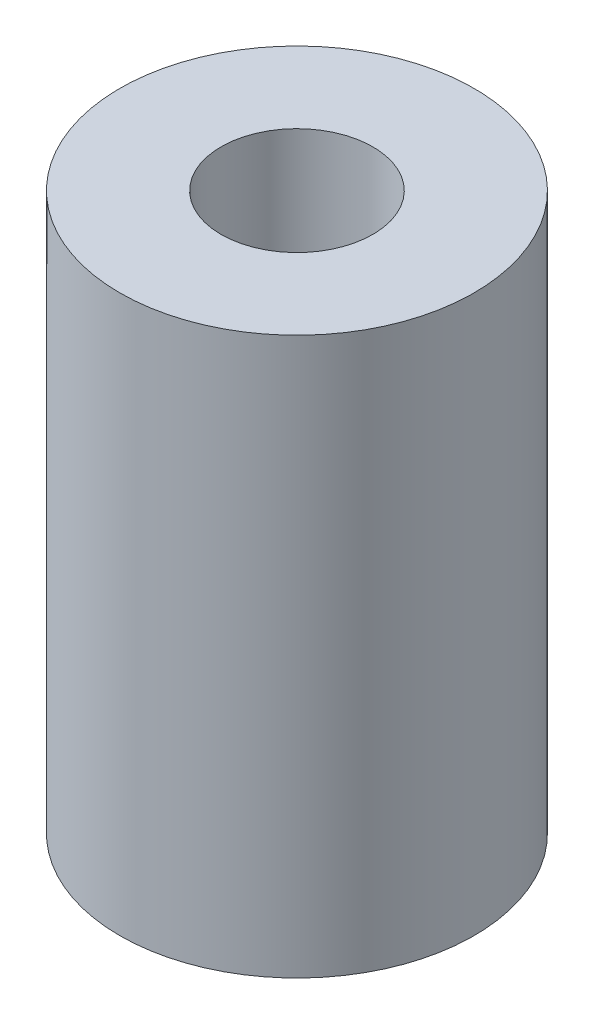
ISO-10303-21;
HEADER;
FILE_DESCRIPTION(('STEP AP214'),'2;1');
FILE_NAME('part.step','',(''),(''),'','','');
FILE_SCHEMA(('AUTOMOTIVE_DESIGN { 1 0 10303 214 1 1 1 1 }'));
ENDSEC;
DATA;
#1=APPLICATION_CONTEXT('core data for automotive mechanical design processes');
#2=APPLICATION_PROTOCOL_DEFINITION('international standard','automotive_design',2000,#1);
#3=PRODUCT_CONTEXT('',#1,'mechanical');
#4=PRODUCT('Part','Part','',(#3));
#5=PRODUCT_RELATED_PRODUCT_CATEGORY('part','',(#4));
#6=PRODUCT_DEFINITION_FORMATION('','',#4);
#7=PRODUCT_DEFINITION_CONTEXT('part definition',#1,'design');
#8=PRODUCT_DEFINITION('design','',#6,#7);
#9=PRODUCT_DEFINITION_SHAPE('','',#8);
#10=(LENGTH_UNIT() NAMED_UNIT(*) SI_UNIT(.MILLI.,.METRE.));
#11=(NAMED_UNIT(*) PLANE_ANGLE_UNIT() SI_UNIT($,.RADIAN.));
#12=(NAMED_UNIT(*) SI_UNIT($,.STERADIAN.) SOLID_ANGLE_UNIT());
#13=UNCERTAINTY_MEASURE_WITH_UNIT(LENGTH_MEASURE(1.E-05),#10,'distance_accuracy_value','');
#14=(GEOMETRIC_REPRESENTATION_CONTEXT(3) GLOBAL_UNCERTAINTY_ASSIGNED_CONTEXT((#13)) GLOBAL_UNIT_ASSIGNED_CONTEXT((#10,
#11,#12)) REPRESENTATION_CONTEXT('',''));
#15=CARTESIAN_POINT('',(0.,0.,0.));
#16=DIRECTION('',(0.,0.,1.));
#17=DIRECTION('',(1.,0.,0.));
#18=AXIS2_PLACEMENT_3D('',#15,#16,#17);
#19=CARTESIAN_POINT('',(0.,11.,0.));
#20=DIRECTION('',(0.,-1.,0.));
#21=DIRECTION('',(0.,0.,-1.));
#22=AXIS2_PLACEMENT_3D('',#19,#20,#21);
#23=CYLINDRICAL_SURFACE('',#22,7.);
#24=CARTESIAN_POINT('',(0.,11.,0.));
#25=DIRECTION('',(0.,1.,0.));
#26=DIRECTION('',(0.,0.,1.));
#27=AXIS2_PLACEMENT_3D('',#24,#25,#26);
#28=CIRCLE('',#27,7.);
#29=CARTESIAN_POINT('',(0.,11.,7.));
#30=VERTEX_POINT('',#29);
#31=EDGE_CURVE('E10',#30,#30,#28,.T.);
#32=ORIENTED_EDGE('',*,*,#31,.F.);
#33=EDGE_LOOP('',(#32));
#34=FACE_BOUND('',#33,.T.);
#35=CARTESIAN_POINT('',(0.,-11.,0.));
#36=DIRECTION('',(0.,1.,0.));
#37=DIRECTION('',(0.,0.,1.));
#38=AXIS2_PLACEMENT_3D('',#35,#36,#37);
#39=CIRCLE('',#38,7.);
#40=CARTESIAN_POINT('',(0.,-11.,7.));
#41=VERTEX_POINT('',#40);
#42=EDGE_CURVE('E38',#41,#41,#39,.T.);
#43=ORIENTED_EDGE('',*,*,#42,.T.);
#44=EDGE_LOOP('',(#43));
#45=FACE_BOUND('',#44,.T.);
#46=ADVANCED_FACE('F35',(#34,#45),#23,.T.);
#47=CARTESIAN_POINT('',(0.,11.,0.));
#48=DIRECTION('',(0.,1.,0.));
#49=DIRECTION('',(0.,0.,1.));
#50=AXIS2_PLACEMENT_3D('',#47,#48,#49);
#51=PLANE('',#50);
#52=CARTESIAN_POINT('',(0.,11.,0.));
#53=DIRECTION('',(0.,1.,0.));
#54=DIRECTION('',(0.,0.,1.));
#55=AXIS2_PLACEMENT_3D('',#52,#53,#54);
#56=CIRCLE('',#55,3.);
#57=CARTESIAN_POINT('',(0.,11.,3.));
#58=VERTEX_POINT('',#57);
#59=EDGE_CURVE('E45',#58,#58,#56,.T.);
#60=ORIENTED_EDGE('',*,*,#59,.F.);
#61=EDGE_LOOP('',(#60));
#62=FACE_BOUND('',#61,.T.);
#63=ORIENTED_EDGE('',*,*,#31,.T.);
#64=EDGE_LOOP('',(#63));
#65=FACE_BOUND('',#64,.T.);
#66=ADVANCED_FACE('F72',(#62,#65),#51,.T.);
#67=CARTESIAN_POINT('',(0.,-11.,0.));
#68=DIRECTION('',(0.,1.,0.));
#69=DIRECTION('',(0.,0.,1.));
#70=AXIS2_PLACEMENT_3D('',#67,#68,#69);
#71=PLANE('',#70);
#72=CARTESIAN_POINT('',(0.,-11.,0.));
#73=DIRECTION('',(0.,-1.,0.));
#74=DIRECTION('',(0.,0.,-1.));
#75=AXIS2_PLACEMENT_3D('',#72,#73,#74);
#76=CIRCLE('',#75,4.);
#77=CARTESIAN_POINT('',(0.,-11.,-4.));
#78=VERTEX_POINT('',#77);
#79=EDGE_CURVE('E53',#78,#78,#76,.T.);
#80=ORIENTED_EDGE('',*,*,#79,.F.);
#81=EDGE_LOOP('',(#80));
#82=FACE_BOUND('',#81,.T.);
#83=ORIENTED_EDGE('',*,*,#42,.F.);
#84=EDGE_LOOP('',(#83));
#85=FACE_BOUND('',#84,.T.);
#86=ADVANCED_FACE('F68',(#82,#85),#71,.F.);
#87=CARTESIAN_POINT('',(0.,0.,0.));
#88=DIRECTION('',(0.,1.,0.));
#89=DIRECTION('',(0.,0.,1.));
#90=AXIS2_PLACEMENT_3D('',#87,#88,#89);
#91=CYLINDRICAL_SURFACE('',#90,3.);
#92=CARTESIAN_POINT('',(0.,0.,0.));
#93=DIRECTION('',(0.,1.,0.));
#94=DIRECTION('',(0.,0.,1.));
#95=AXIS2_PLACEMENT_3D('',#92,#93,#94);
#96=CIRCLE('',#95,3.);
#97=CARTESIAN_POINT('',(0.,0.,3.));
#98=VERTEX_POINT('',#97);
#99=EDGE_CURVE('E49',#98,#98,#96,.T.);
#100=ORIENTED_EDGE('',*,*,#99,.F.);
#101=EDGE_LOOP('',(#100));
#102=FACE_BOUND('',#101,.T.);
#103=ORIENTED_EDGE('',*,*,#59,.T.);
#104=EDGE_LOOP('',(#103));
#105=FACE_BOUND('',#104,.T.);
#106=ADVANCED_FACE('F71',(#102,#105),#91,.F.);
#107=CARTESIAN_POINT('',(0.,0.,0.));
#108=DIRECTION('',(0.,-1.,0.));
#109=DIRECTION('',(0.,0.,-1.));
#110=AXIS2_PLACEMENT_3D('',#107,#108,#109);
#111=PLANE('',#110);
#112=CARTESIAN_POINT('',(0.,0.,0.));
#113=DIRECTION('',(0.,-1.,0.));
#114=DIRECTION('',(0.,0.,-1.));
#115=AXIS2_PLACEMENT_3D('',#112,#113,#114);
#116=CIRCLE('',#115,4.);
#117=CARTESIAN_POINT('',(0.,0.,-4.));
#118=VERTEX_POINT('',#117);
#119=EDGE_CURVE('E52',#118,#118,#116,.T.);
#120=ORIENTED_EDGE('',*,*,#119,.T.);
#121=EDGE_LOOP('',(#120));
#122=FACE_BOUND('',#121,.T.);
#123=ORIENTED_EDGE('',*,*,#99,.T.);
#124=EDGE_LOOP('',(#123));
#125=FACE_BOUND('',#124,.T.);
#126=ADVANCED_FACE('F59',(#122,#125),#111,.T.);
#127=CARTESIAN_POINT('',(0.,0.,0.));
#128=DIRECTION('',(0.,-1.,0.));
#129=DIRECTION('',(0.,0.,-1.));
#130=AXIS2_PLACEMENT_3D('',#127,#128,#129);
#131=CYLINDRICAL_SURFACE('',#130,4.);
#132=ORIENTED_EDGE('',*,*,#119,.F.);
#133=EDGE_LOOP('',(#132));
#134=FACE_BOUND('',#133,.T.);
#135=ORIENTED_EDGE('',*,*,#79,.T.);
#136=EDGE_LOOP('',(#135));
#137=FACE_BOUND('',#136,.T.);
#138=ADVANCED_FACE('F62',(#134,#137),#131,.F.);
#139=CLOSED_SHELL('',(#46,#66,#86,#106,#126,#138));
#140=MANIFOLD_SOLID_BREP('B2',#139);
#141=ADVANCED_BREP_SHAPE_REPRESENTATION('',(#18,#140),#14);
#142=SHAPE_DEFINITION_REPRESENTATION(#9,#141);
ENDSEC;
END-ISO-10303-21;
